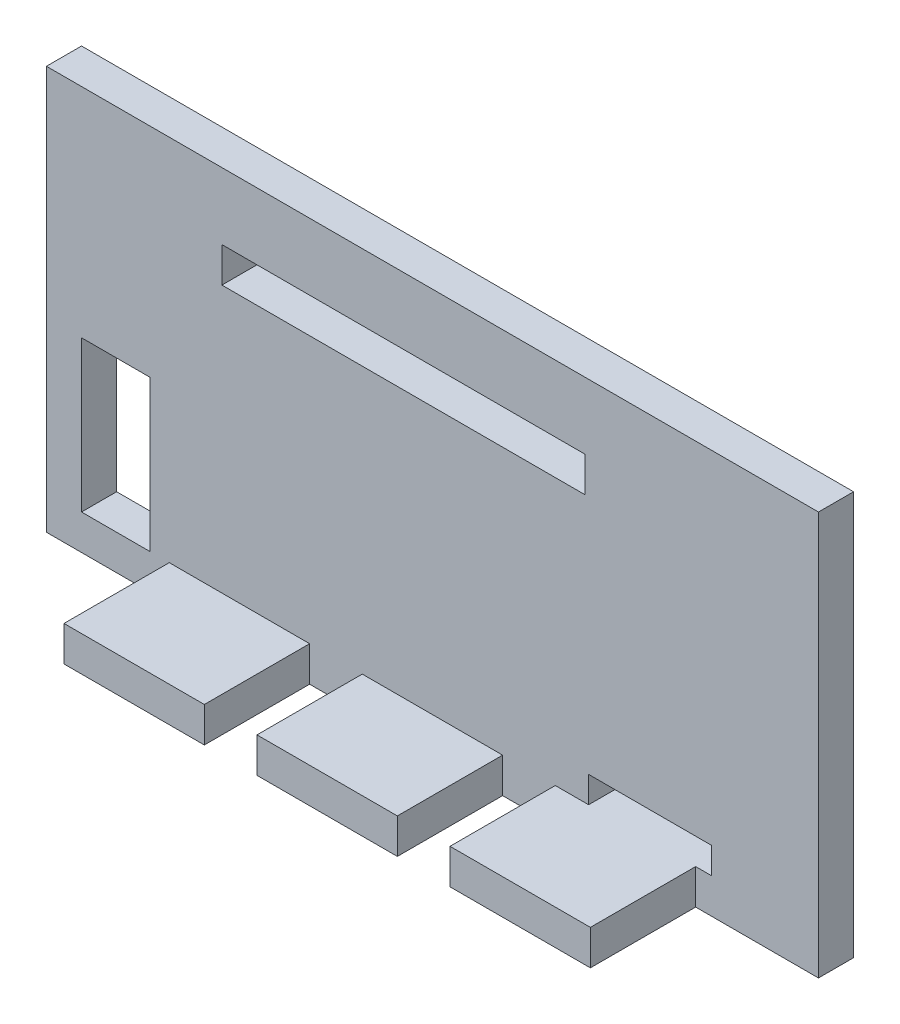
ISO-10303-21;
HEADER;
FILE_DESCRIPTION(('STEP AP214'),'2;1');
FILE_NAME('part.step','',(''),(''),'','','');
FILE_SCHEMA(('AUTOMOTIVE_DESIGN { 1 0 10303 214 1 1 1 1 }'));
ENDSEC;
DATA;
#1=APPLICATION_CONTEXT('core data for automotive mechanical design processes');
#2=APPLICATION_PROTOCOL_DEFINITION('international standard','automotive_design',2000,#1);
#3=PRODUCT_CONTEXT('',#1,'mechanical');
#4=PRODUCT('Part','Part','',(#3));
#5=PRODUCT_RELATED_PRODUCT_CATEGORY('part','',(#4));
#6=PRODUCT_DEFINITION_FORMATION('','',#4);
#7=PRODUCT_DEFINITION_CONTEXT('part definition',#1,'design');
#8=PRODUCT_DEFINITION('design','',#6,#7);
#9=PRODUCT_DEFINITION_SHAPE('','',#8);
#10=(LENGTH_UNIT() NAMED_UNIT(*) SI_UNIT(.MILLI.,.METRE.));
#11=(NAMED_UNIT(*) PLANE_ANGLE_UNIT() SI_UNIT($,.RADIAN.));
#12=(NAMED_UNIT(*) SI_UNIT($,.STERADIAN.) SOLID_ANGLE_UNIT());
#13=UNCERTAINTY_MEASURE_WITH_UNIT(LENGTH_MEASURE(1.E-05),#10,'distance_accuracy_value','');
#14=(GEOMETRIC_REPRESENTATION_CONTEXT(3) GLOBAL_UNCERTAINTY_ASSIGNED_CONTEXT((#13)) GLOBAL_UNIT_ASSIGNED_CONTEXT((#10,
#11,#12)) REPRESENTATION_CONTEXT('',''));
#15=CARTESIAN_POINT('',(0.,0.,0.));
#16=DIRECTION('',(0.,0.,1.));
#17=DIRECTION('',(1.,0.,0.));
#18=AXIS2_PLACEMENT_3D('',#15,#16,#17);
#19=CARTESIAN_POINT('',(0.,0.,2.));
#20=DIRECTION('',(0.,0.,1.));
#21=DIRECTION('',(1.,0.,0.));
#22=AXIS2_PLACEMENT_3D('',#19,#20,#21);
#23=PLANE('',#22);
#24=DIRECTION('',(0.,-1.,0.));
#25=VECTOR('',#24,1.);
#26=CARTESIAN_POINT('',(-20.,-9.5,2.));
#27=LINE('',#26,#25);
#28=CARTESIAN_POINT('',(-20.,-0.899999999999996,2.));
#29=VERTEX_POINT('',#28);
#30=CARTESIAN_POINT('',(-20.,-9.5,2.));
#31=VERTEX_POINT('',#30);
#32=EDGE_CURVE('E317',#29,#31,#27,.T.);
#33=ORIENTED_EDGE('',*,*,#32,.F.);
#34=DIRECTION('',(-1.,0.,0.));
#35=VECTOR('',#34,1.);
#36=CARTESIAN_POINT('',(-20.,-0.899999999999996,2.));
#37=LINE('',#36,#35);
#38=CARTESIAN_POINT('',(-16.1,-0.899999999999996,2.));
#39=VERTEX_POINT('',#38);
#40=EDGE_CURVE('E307',#39,#29,#37,.T.);
#41=ORIENTED_EDGE('',*,*,#40,.F.);
#42=DIRECTION('',(0.,1.,0.));
#43=VECTOR('',#42,1.);
#44=CARTESIAN_POINT('',(-16.1,-9.5,2.));
#45=LINE('',#44,#43);
#46=CARTESIAN_POINT('',(-16.1,-9.5,2.));
#47=VERTEX_POINT('',#46);
#48=EDGE_CURVE('E323',#47,#39,#45,.T.);
#49=ORIENTED_EDGE('',*,*,#48,.F.);
#50=DIRECTION('',(1.,0.,0.));
#51=VECTOR('',#50,1.);
#52=CARTESIAN_POINT('',(-20.,-9.5,2.));
#53=LINE('',#52,#51);
#54=EDGE_CURVE('E319',#31,#47,#53,.T.);
#55=ORIENTED_EDGE('',*,*,#54,.F.);
#56=EDGE_LOOP('',(#33,#41,#49,#55));
#57=FACE_BOUND('',#56,.T.);
#58=DIRECTION('',(0.,-1.,0.));
#59=VECTOR('',#58,1.);
#60=CARTESIAN_POINT('',(-12.,5.7,2.));
#61=LINE('',#60,#59);
#62=CARTESIAN_POINT('',(-12.,7.7,2.));
#63=VERTEX_POINT('',#62);
#64=CARTESIAN_POINT('',(-12.,5.7,2.));
#65=VERTEX_POINT('',#64);
#66=EDGE_CURVE('E302',#63,#65,#61,.T.);
#67=ORIENTED_EDGE('',*,*,#66,.F.);
#68=DIRECTION('',(-1.,0.,0.));
#69=VECTOR('',#68,1.);
#70=CARTESIAN_POINT('',(-12.,7.7,2.));
#71=LINE('',#70,#69);
#72=CARTESIAN_POINT('',(8.70000000000002,7.7,2.));
#73=VERTEX_POINT('',#72);
#74=EDGE_CURVE('E373',#73,#63,#71,.T.);
#75=ORIENTED_EDGE('',*,*,#74,.F.);
#76=DIRECTION('',(0.,1.,0.));
#77=VECTOR('',#76,1.);
#78=CARTESIAN_POINT('',(8.70000000000002,5.7,2.));
#79=LINE('',#78,#77);
#80=CARTESIAN_POINT('',(8.70000000000002,5.7,2.));
#81=VERTEX_POINT('',#80);
#82=EDGE_CURVE('E387',#81,#73,#79,.T.);
#83=ORIENTED_EDGE('',*,*,#82,.F.);
#84=DIRECTION('',(1.,0.,0.));
#85=VECTOR('',#84,1.);
#86=CARTESIAN_POINT('',(-12.,5.7,2.));
#87=LINE('',#86,#85);
#88=EDGE_CURVE('E384',#65,#81,#87,.T.);
#89=ORIENTED_EDGE('',*,*,#88,.F.);
#90=EDGE_LOOP('',(#67,#75,#83,#89));
#91=FACE_BOUND('',#90,.T.);
#92=DIRECTION('',(1.,0.,0.));
#93=VECTOR('',#92,1.);
#94=CARTESIAN_POINT('',(8.90000000000002,-9.5,2.));
#95=LINE('',#94,#93);
#96=CARTESIAN_POINT('',(15.,-9.5,2.));
#97=VERTEX_POINT('',#96);
#98=CARTESIAN_POINT('',(15.9,-9.5,2.));
#99=VERTEX_POINT('',#98);
#100=EDGE_CURVE('E354',#97,#99,#95,.T.);
#101=ORIENTED_EDGE('',*,*,#100,.F.);
#102=DIRECTION('',(0.,1.,0.));
#103=VECTOR('',#102,1.);
#104=CARTESIAN_POINT('',(15.,-11.5,2.));
#105=LINE('',#104,#103);
#106=CARTESIAN_POINT('',(15.,-11.5,2.));
#107=VERTEX_POINT('',#106);
#108=EDGE_CURVE('E48',#107,#97,#105,.T.);
#109=ORIENTED_EDGE('',*,*,#108,.F.);
#110=DIRECTION('',(1.,0.,0.));
#111=VECTOR('',#110,1.);
#112=CARTESIAN_POINT('',(-22.,-11.5,2.));
#113=LINE('',#112,#111);
#114=CARTESIAN_POINT('',(22.,-11.5,2.));
#115=VERTEX_POINT('',#114);
#116=EDGE_CURVE('E407',#107,#115,#113,.T.);
#117=ORIENTED_EDGE('',*,*,#116,.T.);
#118=DIRECTION('',(0.,1.,0.));
#119=VECTOR('',#118,1.);
#120=CARTESIAN_POINT('',(22.,11.5,2.));
#121=LINE('',#120,#119);
#122=CARTESIAN_POINT('',(22.,11.5,2.));
#123=VERTEX_POINT('',#122);
#124=EDGE_CURVE('E399',#115,#123,#121,.T.);
#125=ORIENTED_EDGE('',*,*,#124,.T.);
#126=DIRECTION('',(-1.,0.,0.));
#127=VECTOR('',#126,1.);
#128=CARTESIAN_POINT('',(-22.,11.5,2.));
#129=LINE('',#128,#127);
#130=CARTESIAN_POINT('',(-22.,11.5,2.));
#131=VERTEX_POINT('',#130);
#132=EDGE_CURVE('E402',#123,#131,#129,.T.);
#133=ORIENTED_EDGE('',*,*,#132,.T.);
#134=DIRECTION('',(0.,-1.,0.));
#135=VECTOR('',#134,1.);
#136=CARTESIAN_POINT('',(-22.,11.5,2.));
#137=LINE('',#136,#135);
#138=CARTESIAN_POINT('',(-22.,-11.5,2.));
#139=VERTEX_POINT('',#138);
#140=EDGE_CURVE('E405',#131,#139,#137,.T.);
#141=ORIENTED_EDGE('',*,*,#140,.T.);
#142=CARTESIAN_POINT('',(-15.,-11.5,2.));
#143=VERTEX_POINT('',#142);
#144=EDGE_CURVE('E408',#139,#143,#113,.T.);
#145=ORIENTED_EDGE('',*,*,#144,.T.);
#146=DIRECTION('',(0.,-1.,0.));
#147=VECTOR('',#146,1.);
#148=CARTESIAN_POINT('',(-15.,-11.5,2.));
#149=LINE('',#148,#147);
#150=CARTESIAN_POINT('',(-15.,-9.5,2.));
#151=VERTEX_POINT('',#150);
#152=EDGE_CURVE('E272',#151,#143,#149,.T.);
#153=ORIENTED_EDGE('',*,*,#152,.F.);
#154=DIRECTION('',(-1.,0.,0.));
#155=VECTOR('',#154,1.);
#156=CARTESIAN_POINT('',(-15.,-9.5,2.));
#157=LINE('',#156,#155);
#158=CARTESIAN_POINT('',(-6.99999999999998,-9.5,2.));
#159=VERTEX_POINT('',#158);
#160=EDGE_CURVE('E277',#159,#151,#157,.T.);
#161=ORIENTED_EDGE('',*,*,#160,.F.);
#162=DIRECTION('',(0.,1.,0.));
#163=VECTOR('',#162,1.);
#164=CARTESIAN_POINT('',(-6.99999999999998,-11.5,2.));
#165=LINE('',#164,#163);
#166=CARTESIAN_POINT('',(-6.99999999999998,-11.5,2.));
#167=VERTEX_POINT('',#166);
#168=EDGE_CURVE('E286',#167,#159,#165,.T.);
#169=ORIENTED_EDGE('',*,*,#168,.F.);
#170=CARTESIAN_POINT('',(-3.99999999999998,-11.5,2.));
#171=VERTEX_POINT('',#170);
#172=EDGE_CURVE('E411',#167,#171,#113,.T.);
#173=ORIENTED_EDGE('',*,*,#172,.T.);
#174=DIRECTION('',(0.,-1.,0.));
#175=VECTOR('',#174,1.);
#176=CARTESIAN_POINT('',(-3.99999999999998,-11.5,2.));
#177=LINE('',#176,#175);
#178=CARTESIAN_POINT('',(-3.99999999999998,-9.5,2.));
#179=VERTEX_POINT('',#178);
#180=EDGE_CURVE('E252',#179,#171,#177,.T.);
#181=ORIENTED_EDGE('',*,*,#180,.F.);
#182=DIRECTION('',(-1.,0.,0.));
#183=VECTOR('',#182,1.);
#184=CARTESIAN_POINT('',(-3.99999999999998,-9.5,2.));
#185=LINE('',#184,#183);
#186=CARTESIAN_POINT('',(4.00000000000002,-9.5,2.));
#187=VERTEX_POINT('',#186);
#188=EDGE_CURVE('E56',#187,#179,#185,.T.);
#189=ORIENTED_EDGE('',*,*,#188,.F.);
#190=DIRECTION('',(0.,1.,0.));
#191=VECTOR('',#190,1.);
#192=CARTESIAN_POINT('',(4.00000000000002,-11.5,2.));
#193=LINE('',#192,#191);
#194=CARTESIAN_POINT('',(4.00000000000002,-11.5,2.));
#195=VERTEX_POINT('',#194);
#196=EDGE_CURVE('E240',#195,#187,#193,.T.);
#197=ORIENTED_EDGE('',*,*,#196,.F.);
#198=CARTESIAN_POINT('',(7.00000000000002,-11.5,2.));
#199=VERTEX_POINT('',#198);
#200=EDGE_CURVE('E443',#195,#199,#113,.T.);
#201=ORIENTED_EDGE('',*,*,#200,.T.);
#202=DIRECTION('',(0.,-1.,0.));
#203=VECTOR('',#202,1.);
#204=CARTESIAN_POINT('',(7.00000000000002,-11.5,2.));
#205=LINE('',#204,#203);
#206=CARTESIAN_POINT('',(7.00000000000002,-9.5,2.));
#207=VERTEX_POINT('',#206);
#208=EDGE_CURVE('E237',#207,#199,#205,.T.);
#209=ORIENTED_EDGE('',*,*,#208,.F.);
#210=DIRECTION('',(-1.,0.,0.));
#211=VECTOR('',#210,1.);
#212=CARTESIAN_POINT('',(7.00000000000002,-9.5,2.));
#213=LINE('',#212,#211);
#214=CARTESIAN_POINT('',(8.90000000000002,-9.5,2.));
#215=VERTEX_POINT('',#214);
#216=EDGE_CURVE('E686',#215,#207,#213,.T.);
#217=ORIENTED_EDGE('',*,*,#216,.F.);
#218=DIRECTION('',(0.,-1.,0.));
#219=VECTOR('',#218,1.);
#220=CARTESIAN_POINT('',(8.90000000000002,-9.5,2.));
#221=LINE('',#220,#219);
#222=CARTESIAN_POINT('',(8.90000000000002,-8.,2.));
#223=VERTEX_POINT('',#222);
#224=EDGE_CURVE('E351',#223,#215,#221,.T.);
#225=ORIENTED_EDGE('',*,*,#224,.F.);
#226=DIRECTION('',(-1.,0.,0.));
#227=VECTOR('',#226,1.);
#228=CARTESIAN_POINT('',(8.90000000000002,-8.,2.));
#229=LINE('',#228,#227);
#230=CARTESIAN_POINT('',(15.9,-8.,2.));
#231=VERTEX_POINT('',#230);
#232=EDGE_CURVE('E341',#231,#223,#229,.T.);
#233=ORIENTED_EDGE('',*,*,#232,.F.);
#234=DIRECTION('',(0.,1.,0.));
#235=VECTOR('',#234,1.);
#236=CARTESIAN_POINT('',(15.9,-9.5,2.));
#237=LINE('',#236,#235);
#238=EDGE_CURVE('E357',#99,#231,#237,.T.);
#239=ORIENTED_EDGE('',*,*,#238,.F.);
#240=EDGE_LOOP('',(#101,#109,#117,#125,#133,#141,#145,#153,#161,#169,#173,#181,#189,#197,#201,
#209,#217,#225,#233,#239));
#241=FACE_BOUND('',#240,.T.);
#242=ADVANCED_FACE('F33',(#57,#91,#241),#23,.T.);
#243=CARTESIAN_POINT('',(22.,11.5,2.));
#244=DIRECTION('',(-1.,0.,0.));
#245=DIRECTION('',(0.,-1.,0.));
#246=AXIS2_PLACEMENT_3D('',#243,#244,#245);
#247=PLANE('',#246);
#248=DIRECTION('',(0.,1.,0.));
#249=VECTOR('',#248,1.);
#250=CARTESIAN_POINT('',(22.,11.5,0.));
#251=LINE('',#250,#249);
#252=CARTESIAN_POINT('',(22.,-11.5,0.));
#253=VERTEX_POINT('',#252);
#254=CARTESIAN_POINT('',(22.,11.5,0.));
#255=VERTEX_POINT('',#254);
#256=EDGE_CURVE('E330',#253,#255,#251,.T.);
#257=ORIENTED_EDGE('',*,*,#256,.T.);
#258=DIRECTION('',(0.,0.,-1.));
#259=VECTOR('',#258,1.);
#260=CARTESIAN_POINT('',(22.,11.5,2.));
#261=LINE('',#260,#259);
#262=EDGE_CURVE('E11',#123,#255,#261,.T.);
#263=ORIENTED_EDGE('',*,*,#262,.F.);
#264=ORIENTED_EDGE('',*,*,#124,.F.);
#265=DIRECTION('',(0.,0.,-1.));
#266=VECTOR('',#265,1.);
#267=CARTESIAN_POINT('',(22.,-11.5,2.));
#268=LINE('',#267,#266);
#269=EDGE_CURVE('E410',#115,#253,#268,.T.);
#270=ORIENTED_EDGE('',*,*,#269,.T.);
#271=EDGE_LOOP('',(#257,#263,#264,#270));
#272=FACE_BOUND('',#271,.T.);
#273=ADVANCED_FACE('F35',(#272),#247,.F.);
#274=CARTESIAN_POINT('',(-22.,11.5,2.));
#275=DIRECTION('',(0.,-1.,0.));
#276=DIRECTION('',(0.,0.,-1.));
#277=AXIS2_PLACEMENT_3D('',#274,#275,#276);
#278=PLANE('',#277);
#279=DIRECTION('',(-1.,0.,0.));
#280=VECTOR('',#279,1.);
#281=CARTESIAN_POINT('',(-22.,11.5,0.));
#282=LINE('',#281,#280);
#283=CARTESIAN_POINT('',(-22.,11.5,0.));
#284=VERTEX_POINT('',#283);
#285=EDGE_CURVE('E414',#255,#284,#282,.T.);
#286=ORIENTED_EDGE('',*,*,#285,.T.);
#287=DIRECTION('',(0.,0.,-1.));
#288=VECTOR('',#287,1.);
#289=CARTESIAN_POINT('',(-22.,11.5,2.));
#290=LINE('',#289,#288);
#291=EDGE_CURVE('E41',#131,#284,#290,.T.);
#292=ORIENTED_EDGE('',*,*,#291,.F.);
#293=ORIENTED_EDGE('',*,*,#132,.F.);
#294=ORIENTED_EDGE('',*,*,#262,.T.);
#295=EDGE_LOOP('',(#286,#292,#293,#294));
#296=FACE_BOUND('',#295,.T.);
#297=ADVANCED_FACE('F480',(#296),#278,.F.);
#298=CARTESIAN_POINT('',(-22.,11.5,2.));
#299=DIRECTION('',(1.,0.,0.));
#300=DIRECTION('',(0.,1.,0.));
#301=AXIS2_PLACEMENT_3D('',#298,#299,#300);
#302=PLANE('',#301);
#303=DIRECTION('',(0.,-1.,0.));
#304=VECTOR('',#303,1.);
#305=CARTESIAN_POINT('',(-22.,11.5,0.));
#306=LINE('',#305,#304);
#307=CARTESIAN_POINT('',(-22.,-11.5,0.));
#308=VERTEX_POINT('',#307);
#309=EDGE_CURVE('E416',#284,#308,#306,.T.);
#310=ORIENTED_EDGE('',*,*,#309,.T.);
#311=DIRECTION('',(0.,0.,-1.));
#312=VECTOR('',#311,1.);
#313=CARTESIAN_POINT('',(-22.,-11.5,2.));
#314=LINE('',#313,#312);
#315=EDGE_CURVE('E421',#139,#308,#314,.T.);
#316=ORIENTED_EDGE('',*,*,#315,.F.);
#317=ORIENTED_EDGE('',*,*,#140,.F.);
#318=ORIENTED_EDGE('',*,*,#291,.T.);
#319=EDGE_LOOP('',(#310,#316,#317,#318));
#320=FACE_BOUND('',#319,.T.);
#321=ADVANCED_FACE('F428',(#320),#302,.F.);
#322=CARTESIAN_POINT('',(-22.,-11.5,2.));
#323=DIRECTION('',(0.,1.,0.));
#324=DIRECTION('',(0.,0.,1.));
#325=AXIS2_PLACEMENT_3D('',#322,#323,#324);
#326=PLANE('',#325);
#327=DIRECTION('',(1.,0.,0.));
#328=VECTOR('',#327,1.);
#329=CARTESIAN_POINT('',(-22.,-11.5,0.));
#330=LINE('',#329,#328);
#331=EDGE_CURVE('E403',#308,#253,#330,.T.);
#332=ORIENTED_EDGE('',*,*,#331,.T.);
#333=ORIENTED_EDGE('',*,*,#269,.F.);
#334=ORIENTED_EDGE('',*,*,#116,.F.);
#335=DIRECTION('',(0.,0.,-1.));
#336=VECTOR('',#335,1.);
#337=CARTESIAN_POINT('',(15.,-11.5,8.));
#338=LINE('',#337,#336);
#339=CARTESIAN_POINT('',(15.,-11.5,8.));
#340=VERTEX_POINT('',#339);
#341=EDGE_CURVE('E688',#340,#107,#338,.T.);
#342=ORIENTED_EDGE('',*,*,#341,.F.);
#343=DIRECTION('',(1.,0.,0.));
#344=VECTOR('',#343,1.);
#345=CARTESIAN_POINT('',(7.00000000000002,-11.5,8.));
#346=LINE('',#345,#344);
#347=CARTESIAN_POINT('',(7.00000000000002,-11.5,8.));
#348=VERTEX_POINT('',#347);
#349=EDGE_CURVE('E235',#348,#340,#346,.T.);
#350=ORIENTED_EDGE('',*,*,#349,.F.);
#351=DIRECTION('',(0.,0.,-1.));
#352=VECTOR('',#351,1.);
#353=CARTESIAN_POINT('',(7.00000000000002,-11.5,8.));
#354=LINE('',#353,#352);
#355=EDGE_CURVE('E244',#348,#199,#354,.T.);
#356=ORIENTED_EDGE('',*,*,#355,.T.);
#357=ORIENTED_EDGE('',*,*,#200,.F.);
#358=DIRECTION('',(0.,0.,-1.));
#359=VECTOR('',#358,1.);
#360=CARTESIAN_POINT('',(4.00000000000002,-11.5,8.));
#361=LINE('',#360,#359);
#362=CARTESIAN_POINT('',(4.00000000000002,-11.5,8.));
#363=VERTEX_POINT('',#362);
#364=EDGE_CURVE('E257',#363,#195,#361,.T.);
#365=ORIENTED_EDGE('',*,*,#364,.F.);
#366=DIRECTION('',(1.,0.,0.));
#367=VECTOR('',#366,1.);
#368=CARTESIAN_POINT('',(-3.99999999999998,-11.5,8.));
#369=LINE('',#368,#367);
#370=CARTESIAN_POINT('',(-3.99999999999998,-11.5,8.));
#371=VERTEX_POINT('',#370);
#372=EDGE_CURVE('E256',#371,#363,#369,.T.);
#373=ORIENTED_EDGE('',*,*,#372,.F.);
#374=DIRECTION('',(0.,0.,-1.));
#375=VECTOR('',#374,1.);
#376=CARTESIAN_POINT('',(-3.99999999999998,-11.5,8.));
#377=LINE('',#376,#375);
#378=EDGE_CURVE('E264',#371,#171,#377,.T.);
#379=ORIENTED_EDGE('',*,*,#378,.T.);
#380=ORIENTED_EDGE('',*,*,#172,.F.);
#381=DIRECTION('',(0.,0.,-1.));
#382=VECTOR('',#381,1.);
#383=CARTESIAN_POINT('',(-6.99999999999998,-11.5,8.));
#384=LINE('',#383,#382);
#385=CARTESIAN_POINT('',(-6.99999999999998,-11.5,8.));
#386=VERTEX_POINT('',#385);
#387=EDGE_CURVE('E296',#386,#167,#384,.T.);
#388=ORIENTED_EDGE('',*,*,#387,.F.);
#389=DIRECTION('',(1.,0.,0.));
#390=VECTOR('',#389,1.);
#391=CARTESIAN_POINT('',(-15.,-11.5,8.));
#392=LINE('',#391,#390);
#393=CARTESIAN_POINT('',(-15.,-11.5,8.));
#394=VERTEX_POINT('',#393);
#395=EDGE_CURVE('E276',#394,#386,#392,.T.);
#396=ORIENTED_EDGE('',*,*,#395,.F.);
#397=DIRECTION('',(0.,0.,-1.));
#398=VECTOR('',#397,1.);
#399=CARTESIAN_POINT('',(-15.,-11.5,8.));
#400=LINE('',#399,#398);
#401=EDGE_CURVE('E299',#394,#143,#400,.T.);
#402=ORIENTED_EDGE('',*,*,#401,.T.);
#403=ORIENTED_EDGE('',*,*,#144,.F.);
#404=ORIENTED_EDGE('',*,*,#315,.T.);
#405=EDGE_LOOP('',(#332,#333,#334,#342,#350,#356,#357,#365,#373,#379,#380,#388,#396,#402,#403,#404));
#406=FACE_BOUND('',#405,.T.);
#407=ADVANCED_FACE('F437',(#406),#326,.F.);
#408=CARTESIAN_POINT('',(0.,0.,0.));
#409=DIRECTION('',(0.,0.,1.));
#410=DIRECTION('',(1.,0.,0.));
#411=AXIS2_PLACEMENT_3D('',#408,#409,#410);
#412=PLANE('',#411);
#413=DIRECTION('',(-1.,0.,0.));
#414=VECTOR('',#413,1.);
#415=CARTESIAN_POINT('',(-20.,-0.899999999999996,0.));
#416=LINE('',#415,#414);
#417=CARTESIAN_POINT('',(-16.1,-0.899999999999996,0.));
#418=VERTEX_POINT('',#417);
#419=CARTESIAN_POINT('',(-20.,-0.899999999999996,0.));
#420=VERTEX_POINT('',#419);
#421=EDGE_CURVE('E313',#418,#420,#416,.T.);
#422=ORIENTED_EDGE('',*,*,#421,.T.);
#423=DIRECTION('',(0.,-1.,0.));
#424=VECTOR('',#423,1.);
#425=CARTESIAN_POINT('',(-20.,-9.5,0.));
#426=LINE('',#425,#424);
#427=CARTESIAN_POINT('',(-20.,-9.5,0.));
#428=VERTEX_POINT('',#427);
#429=EDGE_CURVE('E303',#420,#428,#426,.T.);
#430=ORIENTED_EDGE('',*,*,#429,.T.);
#431=DIRECTION('',(1.,0.,0.));
#432=VECTOR('',#431,1.);
#433=CARTESIAN_POINT('',(-20.,-9.5,0.));
#434=LINE('',#433,#432);
#435=CARTESIAN_POINT('',(-16.1,-9.5,0.));
#436=VERTEX_POINT('',#435);
#437=EDGE_CURVE('E306',#428,#436,#434,.T.);
#438=ORIENTED_EDGE('',*,*,#437,.T.);
#439=DIRECTION('',(0.,1.,0.));
#440=VECTOR('',#439,1.);
#441=CARTESIAN_POINT('',(-16.1,-9.5,0.));
#442=LINE('',#441,#440);
#443=EDGE_CURVE('E310',#436,#418,#442,.T.);
#444=ORIENTED_EDGE('',*,*,#443,.T.);
#445=EDGE_LOOP('',(#422,#430,#438,#444));
#446=FACE_BOUND('',#445,.T.);
#447=DIRECTION('',(-1.,0.,0.));
#448=VECTOR('',#447,1.);
#449=CARTESIAN_POINT('',(8.90000000000002,-8.,0.));
#450=LINE('',#449,#448);
#451=CARTESIAN_POINT('',(15.9,-8.,0.));
#452=VERTEX_POINT('',#451);
#453=CARTESIAN_POINT('',(8.90000000000002,-8.,0.));
#454=VERTEX_POINT('',#453);
#455=EDGE_CURVE('E347',#452,#454,#450,.T.);
#456=ORIENTED_EDGE('',*,*,#455,.T.);
#457=DIRECTION('',(0.,-1.,0.));
#458=VECTOR('',#457,1.);
#459=CARTESIAN_POINT('',(8.90000000000002,-9.5,0.));
#460=LINE('',#459,#458);
#461=CARTESIAN_POINT('',(8.90000000000002,-9.5,0.));
#462=VERTEX_POINT('',#461);
#463=EDGE_CURVE('E337',#454,#462,#460,.T.);
#464=ORIENTED_EDGE('',*,*,#463,.T.);
#465=DIRECTION('',(1.,0.,0.));
#466=VECTOR('',#465,1.);
#467=CARTESIAN_POINT('',(8.90000000000002,-9.5,0.));
#468=LINE('',#467,#466);
#469=CARTESIAN_POINT('',(15.9,-9.5,0.));
#470=VERTEX_POINT('',#469);
#471=EDGE_CURVE('E340',#462,#470,#468,.T.);
#472=ORIENTED_EDGE('',*,*,#471,.T.);
#473=DIRECTION('',(0.,1.,0.));
#474=VECTOR('',#473,1.);
#475=CARTESIAN_POINT('',(15.9,-9.5,0.));
#476=LINE('',#475,#474);
#477=EDGE_CURVE('E344',#470,#452,#476,.T.);
#478=ORIENTED_EDGE('',*,*,#477,.T.);
#479=EDGE_LOOP('',(#456,#464,#472,#478));
#480=FACE_BOUND('',#479,.T.);
#481=DIRECTION('',(-1.,0.,0.));
#482=VECTOR('',#481,1.);
#483=CARTESIAN_POINT('',(-12.,7.7,0.));
#484=LINE('',#483,#482);
#485=CARTESIAN_POINT('',(8.70000000000002,7.7,0.));
#486=VERTEX_POINT('',#485);
#487=CARTESIAN_POINT('',(-12.,7.7,0.));
#488=VERTEX_POINT('',#487);
#489=EDGE_CURVE('E379',#486,#488,#484,.T.);
#490=ORIENTED_EDGE('',*,*,#489,.T.);
#491=DIRECTION('',(0.,-1.,0.));
#492=VECTOR('',#491,1.);
#493=CARTESIAN_POINT('',(-12.,5.7,0.));
#494=LINE('',#493,#492);
#495=CARTESIAN_POINT('',(-12.,5.7,0.));
#496=VERTEX_POINT('',#495);
#497=EDGE_CURVE('E369',#488,#496,#494,.T.);
#498=ORIENTED_EDGE('',*,*,#497,.T.);
#499=DIRECTION('',(1.,0.,0.));
#500=VECTOR('',#499,1.);
#501=CARTESIAN_POINT('',(-12.,5.7,0.));
#502=LINE('',#501,#500);
#503=CARTESIAN_POINT('',(8.70000000000002,5.7,0.));
#504=VERTEX_POINT('',#503);
#505=EDGE_CURVE('E372',#496,#504,#502,.T.);
#506=ORIENTED_EDGE('',*,*,#505,.T.);
#507=DIRECTION('',(0.,1.,0.));
#508=VECTOR('',#507,1.);
#509=CARTESIAN_POINT('',(8.70000000000002,5.7,0.));
#510=LINE('',#509,#508);
#511=EDGE_CURVE('E376',#504,#486,#510,.T.);
#512=ORIENTED_EDGE('',*,*,#511,.T.);
#513=EDGE_LOOP('',(#490,#498,#506,#512));
#514=FACE_BOUND('',#513,.T.);
#515=ORIENTED_EDGE('',*,*,#256,.F.);
#516=ORIENTED_EDGE('',*,*,#331,.F.);
#517=ORIENTED_EDGE('',*,*,#309,.F.);
#518=ORIENTED_EDGE('',*,*,#285,.F.);
#519=EDGE_LOOP('',(#515,#516,#517,#518));
#520=FACE_BOUND('',#519,.T.);
#521=ADVANCED_FACE('F434',(#446,#480,#514,#520),#412,.F.);
#522=CARTESIAN_POINT('',(-12.,5.7,0.));
#523=DIRECTION('',(-1.,0.,0.));
#524=DIRECTION('',(0.,0.,1.));
#525=AXIS2_PLACEMENT_3D('',#522,#523,#524);
#526=PLANE('',#525);
#527=ORIENTED_EDGE('',*,*,#66,.T.);
#528=DIRECTION('',(0.,0.,1.));
#529=VECTOR('',#528,1.);
#530=CARTESIAN_POINT('',(-12.,5.7,0.));
#531=LINE('',#530,#529);
#532=EDGE_CURVE('E382',#496,#65,#531,.T.);
#533=ORIENTED_EDGE('',*,*,#532,.F.);
#534=ORIENTED_EDGE('',*,*,#497,.F.);
#535=DIRECTION('',(0.,0.,1.));
#536=VECTOR('',#535,1.);
#537=CARTESIAN_POINT('',(-12.,7.7,0.));
#538=LINE('',#537,#536);
#539=EDGE_CURVE('E355',#488,#63,#538,.T.);
#540=ORIENTED_EDGE('',*,*,#539,.T.);
#541=EDGE_LOOP('',(#527,#533,#534,#540));
#542=FACE_BOUND('',#541,.T.);
#543=ADVANCED_FACE('F485',(#542),#526,.F.);
#544=CARTESIAN_POINT('',(-12.,7.7,0.));
#545=DIRECTION('',(0.,1.,0.));
#546=DIRECTION('',(0.,0.,1.));
#547=AXIS2_PLACEMENT_3D('',#544,#545,#546);
#548=PLANE('',#547);
#549=ORIENTED_EDGE('',*,*,#74,.T.);
#550=ORIENTED_EDGE('',*,*,#539,.F.);
#551=ORIENTED_EDGE('',*,*,#489,.F.);
#552=DIRECTION('',(0.,0.,1.));
#553=VECTOR('',#552,1.);
#554=CARTESIAN_POINT('',(8.70000000000002,7.7,0.));
#555=LINE('',#554,#553);
#556=EDGE_CURVE('E393',#486,#73,#555,.T.);
#557=ORIENTED_EDGE('',*,*,#556,.T.);
#558=EDGE_LOOP('',(#549,#550,#551,#557));
#559=FACE_BOUND('',#558,.T.);
#560=ADVANCED_FACE('F517',(#559),#548,.F.);
#561=CARTESIAN_POINT('',(8.70000000000002,5.7,0.));
#562=DIRECTION('',(1.,0.,0.));
#563=DIRECTION('',(0.,0.,-1.));
#564=AXIS2_PLACEMENT_3D('',#561,#562,#563);
#565=PLANE('',#564);
#566=ORIENTED_EDGE('',*,*,#82,.T.);
#567=ORIENTED_EDGE('',*,*,#556,.F.);
#568=ORIENTED_EDGE('',*,*,#511,.F.);
#569=DIRECTION('',(0.,0.,1.));
#570=VECTOR('',#569,1.);
#571=CARTESIAN_POINT('',(8.70000000000002,5.7,0.));
#572=LINE('',#571,#570);
#573=EDGE_CURVE('E395',#504,#81,#572,.T.);
#574=ORIENTED_EDGE('',*,*,#573,.T.);
#575=EDGE_LOOP('',(#566,#567,#568,#574));
#576=FACE_BOUND('',#575,.T.);
#577=ADVANCED_FACE('F524',(#576),#565,.F.);
#578=CARTESIAN_POINT('',(-12.,5.7,0.));
#579=DIRECTION('',(0.,-1.,0.));
#580=DIRECTION('',(0.,0.,-1.));
#581=AXIS2_PLACEMENT_3D('',#578,#579,#580);
#582=PLANE('',#581);
#583=ORIENTED_EDGE('',*,*,#88,.T.);
#584=ORIENTED_EDGE('',*,*,#573,.F.);
#585=ORIENTED_EDGE('',*,*,#505,.F.);
#586=ORIENTED_EDGE('',*,*,#532,.T.);
#587=EDGE_LOOP('',(#583,#584,#585,#586));
#588=FACE_BOUND('',#587,.T.);
#589=ADVANCED_FACE('F532',(#588),#582,.F.);
#590=CARTESIAN_POINT('',(8.90000000000002,-9.5,0.));
#591=DIRECTION('',(-1.,0.,0.));
#592=DIRECTION('',(0.,0.,1.));
#593=AXIS2_PLACEMENT_3D('',#590,#591,#592);
#594=PLANE('',#593);
#595=ORIENTED_EDGE('',*,*,#224,.T.);
#596=DIRECTION('',(0.,0.,1.));
#597=VECTOR('',#596,1.);
#598=CARTESIAN_POINT('',(8.90000000000002,-9.5,0.));
#599=LINE('',#598,#597);
#600=EDGE_CURVE('E350',#462,#215,#599,.T.);
#601=ORIENTED_EDGE('',*,*,#600,.F.);
#602=ORIENTED_EDGE('',*,*,#463,.F.);
#603=DIRECTION('',(0.,0.,1.));
#604=VECTOR('',#603,1.);
#605=CARTESIAN_POINT('',(8.90000000000002,-8.,0.));
#606=LINE('',#605,#604);
#607=EDGE_CURVE('E320',#454,#223,#606,.T.);
#608=ORIENTED_EDGE('',*,*,#607,.T.);
#609=EDGE_LOOP('',(#595,#601,#602,#608));
#610=FACE_BOUND('',#609,.T.);
#611=ADVANCED_FACE('F540',(#610),#594,.F.);
#612=CARTESIAN_POINT('',(8.90000000000002,-8.,0.));
#613=DIRECTION('',(0.,1.,0.));
#614=DIRECTION('',(0.,0.,1.));
#615=AXIS2_PLACEMENT_3D('',#612,#613,#614);
#616=PLANE('',#615);
#617=ORIENTED_EDGE('',*,*,#232,.T.);
#618=ORIENTED_EDGE('',*,*,#607,.F.);
#619=ORIENTED_EDGE('',*,*,#455,.F.);
#620=DIRECTION('',(0.,0.,1.));
#621=VECTOR('',#620,1.);
#622=CARTESIAN_POINT('',(15.9,-8.,0.));
#623=LINE('',#622,#621);
#624=EDGE_CURVE('E363',#452,#231,#623,.T.);
#625=ORIENTED_EDGE('',*,*,#624,.T.);
#626=EDGE_LOOP('',(#617,#618,#619,#625));
#627=FACE_BOUND('',#626,.T.);
#628=ADVANCED_FACE('F547',(#627),#616,.F.);
#629=CARTESIAN_POINT('',(15.9,-9.5,0.));
#630=DIRECTION('',(1.,0.,0.));
#631=DIRECTION('',(0.,0.,-1.));
#632=AXIS2_PLACEMENT_3D('',#629,#630,#631);
#633=PLANE('',#632);
#634=ORIENTED_EDGE('',*,*,#238,.T.);
#635=ORIENTED_EDGE('',*,*,#624,.F.);
#636=ORIENTED_EDGE('',*,*,#477,.F.);
#637=DIRECTION('',(0.,0.,1.));
#638=VECTOR('',#637,1.);
#639=CARTESIAN_POINT('',(15.9,-9.5,0.));
#640=LINE('',#639,#638);
#641=EDGE_CURVE('E365',#470,#99,#640,.T.);
#642=ORIENTED_EDGE('',*,*,#641,.T.);
#643=EDGE_LOOP('',(#634,#635,#636,#642));
#644=FACE_BOUND('',#643,.T.);
#645=ADVANCED_FACE('F555',(#644),#633,.F.);
#646=CARTESIAN_POINT('',(8.90000000000002,-9.5,0.));
#647=DIRECTION('',(0.,-1.,0.));
#648=DIRECTION('',(0.,0.,-1.));
#649=AXIS2_PLACEMENT_3D('',#646,#647,#648);
#650=PLANE('',#649);
#651=ORIENTED_EDGE('',*,*,#600,.T.);
#652=ORIENTED_EDGE('',*,*,#216,.T.);
#653=DIRECTION('',(0.,0.,-1.));
#654=VECTOR('',#653,1.);
#655=CARTESIAN_POINT('',(7.00000000000002,-9.5,8.));
#656=LINE('',#655,#654);
#657=CARTESIAN_POINT('',(7.00000000000002,-9.5,8.));
#658=VERTEX_POINT('',#657);
#659=EDGE_CURVE('E226',#658,#207,#656,.T.);
#660=ORIENTED_EDGE('',*,*,#659,.F.);
#661=DIRECTION('',(-1.,0.,0.));
#662=VECTOR('',#661,1.);
#663=CARTESIAN_POINT('',(7.00000000000002,-9.5,8.));
#664=LINE('',#663,#662);
#665=CARTESIAN_POINT('',(15.,-9.5,8.));
#666=VERTEX_POINT('',#665);
#667=EDGE_CURVE('E219',#666,#658,#664,.T.);
#668=ORIENTED_EDGE('',*,*,#667,.F.);
#669=DIRECTION('',(0.,0.,-1.));
#670=VECTOR('',#669,1.);
#671=CARTESIAN_POINT('',(15.,-9.5,8.));
#672=LINE('',#671,#670);
#673=EDGE_CURVE('E223',#666,#97,#672,.T.);
#674=ORIENTED_EDGE('',*,*,#673,.T.);
#675=ORIENTED_EDGE('',*,*,#100,.T.);
#676=ORIENTED_EDGE('',*,*,#641,.F.);
#677=ORIENTED_EDGE('',*,*,#471,.F.);
#678=EDGE_LOOP('',(#651,#652,#660,#668,#674,#675,#676,#677));
#679=FACE_BOUND('',#678,.T.);
#680=ADVANCED_FACE('F222',(#679),#650,.F.);
#681=CARTESIAN_POINT('',(-20.,-9.5,0.));
#682=DIRECTION('',(-1.,0.,0.));
#683=DIRECTION('',(0.,0.,1.));
#684=AXIS2_PLACEMENT_3D('',#681,#682,#683);
#685=PLANE('',#684);
#686=ORIENTED_EDGE('',*,*,#32,.T.);
#687=DIRECTION('',(0.,0.,1.));
#688=VECTOR('',#687,1.);
#689=CARTESIAN_POINT('',(-20.,-9.5,0.));
#690=LINE('',#689,#688);
#691=EDGE_CURVE('E316',#428,#31,#690,.T.);
#692=ORIENTED_EDGE('',*,*,#691,.F.);
#693=ORIENTED_EDGE('',*,*,#429,.F.);
#694=DIRECTION('',(0.,0.,1.));
#695=VECTOR('',#694,1.);
#696=CARTESIAN_POINT('',(-20.,-0.899999999999996,0.));
#697=LINE('',#696,#695);
#698=EDGE_CURVE('E328',#420,#29,#697,.T.);
#699=ORIENTED_EDGE('',*,*,#698,.T.);
#700=EDGE_LOOP('',(#686,#692,#693,#699));
#701=FACE_BOUND('',#700,.T.);
#702=ADVANCED_FACE('F570',(#701),#685,.F.);
#703=CARTESIAN_POINT('',(-20.,-0.899999999999996,0.));
#704=DIRECTION('',(0.,1.,0.));
#705=DIRECTION('',(0.,0.,1.));
#706=AXIS2_PLACEMENT_3D('',#703,#704,#705);
#707=PLANE('',#706);
#708=ORIENTED_EDGE('',*,*,#40,.T.);
#709=ORIENTED_EDGE('',*,*,#698,.F.);
#710=ORIENTED_EDGE('',*,*,#421,.F.);
#711=DIRECTION('',(0.,0.,1.));
#712=VECTOR('',#711,1.);
#713=CARTESIAN_POINT('',(-16.1,-0.899999999999996,0.));
#714=LINE('',#713,#712);
#715=EDGE_CURVE('E331',#418,#39,#714,.T.);
#716=ORIENTED_EDGE('',*,*,#715,.T.);
#717=EDGE_LOOP('',(#708,#709,#710,#716));
#718=FACE_BOUND('',#717,.T.);
#719=ADVANCED_FACE('F577',(#718),#707,.F.);
#720=CARTESIAN_POINT('',(-16.1,-9.5,0.));
#721=DIRECTION('',(1.,0.,0.));
#722=DIRECTION('',(0.,0.,-1.));
#723=AXIS2_PLACEMENT_3D('',#720,#721,#722);
#724=PLANE('',#723);
#725=ORIENTED_EDGE('',*,*,#48,.T.);
#726=ORIENTED_EDGE('',*,*,#715,.F.);
#727=ORIENTED_EDGE('',*,*,#443,.F.);
#728=DIRECTION('',(0.,0.,1.));
#729=VECTOR('',#728,1.);
#730=CARTESIAN_POINT('',(-16.1,-9.5,0.));
#731=LINE('',#730,#729);
#732=EDGE_CURVE('E333',#436,#47,#731,.T.);
#733=ORIENTED_EDGE('',*,*,#732,.T.);
#734=EDGE_LOOP('',(#725,#726,#727,#733));
#735=FACE_BOUND('',#734,.T.);
#736=ADVANCED_FACE('F585',(#735),#724,.F.);
#737=CARTESIAN_POINT('',(-20.,-9.5,0.));
#738=DIRECTION('',(0.,-1.,0.));
#739=DIRECTION('',(0.,0.,-1.));
#740=AXIS2_PLACEMENT_3D('',#737,#738,#739);
#741=PLANE('',#740);
#742=ORIENTED_EDGE('',*,*,#54,.T.);
#743=ORIENTED_EDGE('',*,*,#732,.F.);
#744=ORIENTED_EDGE('',*,*,#437,.F.);
#745=ORIENTED_EDGE('',*,*,#691,.T.);
#746=EDGE_LOOP('',(#742,#743,#744,#745));
#747=FACE_BOUND('',#746,.T.);
#748=ADVANCED_FACE('F593',(#747),#741,.F.);
#749=CARTESIAN_POINT('',(-15.,-11.5,8.));
#750=DIRECTION('',(1.,0.,0.));
#751=DIRECTION('',(0.,0.,-1.));
#752=AXIS2_PLACEMENT_3D('',#749,#750,#751);
#753=PLANE('',#752);
#754=ORIENTED_EDGE('',*,*,#152,.T.);
#755=ORIENTED_EDGE('',*,*,#401,.F.);
#756=DIRECTION('',(0.,-1.,0.));
#757=VECTOR('',#756,1.);
#758=CARTESIAN_POINT('',(-15.,-11.5,8.));
#759=LINE('',#758,#757);
#760=CARTESIAN_POINT('',(-15.,-9.5,8.));
#761=VERTEX_POINT('',#760);
#762=EDGE_CURVE('E273',#761,#394,#759,.T.);
#763=ORIENTED_EDGE('',*,*,#762,.F.);
#764=DIRECTION('',(0.,0.,-1.));
#765=VECTOR('',#764,1.);
#766=CARTESIAN_POINT('',(-15.,-9.5,8.));
#767=LINE('',#766,#765);
#768=EDGE_CURVE('E283',#761,#151,#767,.T.);
#769=ORIENTED_EDGE('',*,*,#768,.T.);
#770=EDGE_LOOP('',(#754,#755,#763,#769));
#771=FACE_BOUND('',#770,.T.);
#772=ADVANCED_FACE('F601',(#771),#753,.F.);
#773=CARTESIAN_POINT('',(-6.99999999999998,-11.5,8.));
#774=DIRECTION('',(-1.,0.,0.));
#775=DIRECTION('',(0.,0.,1.));
#776=AXIS2_PLACEMENT_3D('',#773,#774,#775);
#777=PLANE('',#776);
#778=ORIENTED_EDGE('',*,*,#168,.T.);
#779=DIRECTION('',(0.,0.,-1.));
#780=VECTOR('',#779,1.);
#781=CARTESIAN_POINT('',(-6.99999999999998,-9.5,8.));
#782=LINE('',#781,#780);
#783=CARTESIAN_POINT('',(-6.99999999999998,-9.5,8.));
#784=VERTEX_POINT('',#783);
#785=EDGE_CURVE('E293',#784,#159,#782,.T.);
#786=ORIENTED_EDGE('',*,*,#785,.F.);
#787=DIRECTION('',(0.,1.,0.));
#788=VECTOR('',#787,1.);
#789=CARTESIAN_POINT('',(-6.99999999999998,-11.5,8.));
#790=LINE('',#789,#788);
#791=EDGE_CURVE('E279',#386,#784,#790,.T.);
#792=ORIENTED_EDGE('',*,*,#791,.F.);
#793=ORIENTED_EDGE('',*,*,#387,.T.);
#794=EDGE_LOOP('',(#778,#786,#792,#793));
#795=FACE_BOUND('',#794,.T.);
#796=ADVANCED_FACE('F608',(#795),#777,.F.);
#797=CARTESIAN_POINT('',(-15.,-9.5,8.));
#798=DIRECTION('',(0.,-1.,0.));
#799=DIRECTION('',(0.,0.,-1.));
#800=AXIS2_PLACEMENT_3D('',#797,#798,#799);
#801=PLANE('',#800);
#802=ORIENTED_EDGE('',*,*,#160,.T.);
#803=ORIENTED_EDGE('',*,*,#768,.F.);
#804=DIRECTION('',(-1.,0.,0.));
#805=VECTOR('',#804,1.);
#806=CARTESIAN_POINT('',(-15.,-9.5,8.));
#807=LINE('',#806,#805);
#808=EDGE_CURVE('E281',#784,#761,#807,.T.);
#809=ORIENTED_EDGE('',*,*,#808,.F.);
#810=ORIENTED_EDGE('',*,*,#785,.T.);
#811=EDGE_LOOP('',(#802,#803,#809,#810));
#812=FACE_BOUND('',#811,.T.);
#813=ADVANCED_FACE('F471',(#812),#801,.F.);
#814=CARTESIAN_POINT('',(0.,0.,8.));
#815=DIRECTION('',(0.,0.,-1.));
#816=DIRECTION('',(-1.,0.,0.));
#817=AXIS2_PLACEMENT_3D('',#814,#815,#816);
#818=PLANE('',#817);
#819=ORIENTED_EDGE('',*,*,#762,.T.);
#820=ORIENTED_EDGE('',*,*,#395,.T.);
#821=ORIENTED_EDGE('',*,*,#791,.T.);
#822=ORIENTED_EDGE('',*,*,#808,.T.);
#823=EDGE_LOOP('',(#819,#820,#821,#822));
#824=FACE_BOUND('',#823,.T.);
#825=ADVANCED_FACE('F464',(#824),#818,.F.);
#826=CARTESIAN_POINT('',(4.00000000000002,-11.5,8.));
#827=DIRECTION('',(-1.,0.,0.));
#828=DIRECTION('',(0.,0.,1.));
#829=AXIS2_PLACEMENT_3D('',#826,#827,#828);
#830=PLANE('',#829);
#831=ORIENTED_EDGE('',*,*,#196,.T.);
#832=DIRECTION('',(0.,0.,-1.));
#833=VECTOR('',#832,1.);
#834=CARTESIAN_POINT('',(4.00000000000002,-9.5,8.));
#835=LINE('',#834,#833);
#836=CARTESIAN_POINT('',(4.00000000000002,-9.5,8.));
#837=VERTEX_POINT('',#836);
#838=EDGE_CURVE('E270',#837,#187,#835,.T.);
#839=ORIENTED_EDGE('',*,*,#838,.F.);
#840=DIRECTION('',(0.,1.,0.));
#841=VECTOR('',#840,1.);
#842=CARTESIAN_POINT('',(4.00000000000002,-11.5,8.));
#843=LINE('',#842,#841);
#844=EDGE_CURVE('E248',#363,#837,#843,.T.);
#845=ORIENTED_EDGE('',*,*,#844,.F.);
#846=ORIENTED_EDGE('',*,*,#364,.T.);
#847=EDGE_LOOP('',(#831,#839,#845,#846));
#848=FACE_BOUND('',#847,.T.);
#849=ADVANCED_FACE('F462',(#848),#830,.F.);
#850=CARTESIAN_POINT('',(-3.99999999999998,-9.5,8.));
#851=DIRECTION('',(0.,-1.,0.));
#852=DIRECTION('',(0.,0.,-1.));
#853=AXIS2_PLACEMENT_3D('',#850,#851,#852);
#854=PLANE('',#853);
#855=ORIENTED_EDGE('',*,*,#188,.T.);
#856=DIRECTION('',(0.,0.,-1.));
#857=VECTOR('',#856,1.);
#858=CARTESIAN_POINT('',(-3.99999999999998,-9.5,8.));
#859=LINE('',#858,#857);
#860=CARTESIAN_POINT('',(-3.99999999999998,-9.5,8.));
#861=VERTEX_POINT('',#860);
#862=EDGE_CURVE('E267',#861,#179,#859,.T.);
#863=ORIENTED_EDGE('',*,*,#862,.F.);
#864=DIRECTION('',(-1.,0.,0.));
#865=VECTOR('',#864,1.);
#866=CARTESIAN_POINT('',(-3.99999999999998,-9.5,8.));
#867=LINE('',#866,#865);
#868=EDGE_CURVE('E251',#837,#861,#867,.T.);
#869=ORIENTED_EDGE('',*,*,#868,.F.);
#870=ORIENTED_EDGE('',*,*,#838,.T.);
#871=EDGE_LOOP('',(#855,#863,#869,#870));
#872=FACE_BOUND('',#871,.T.);
#873=ADVANCED_FACE('F460',(#872),#854,.F.);
#874=CARTESIAN_POINT('',(-3.99999999999998,-11.5,8.));
#875=DIRECTION('',(1.,0.,0.));
#876=DIRECTION('',(0.,0.,-1.));
#877=AXIS2_PLACEMENT_3D('',#874,#875,#876);
#878=PLANE('',#877);
#879=ORIENTED_EDGE('',*,*,#180,.T.);
#880=ORIENTED_EDGE('',*,*,#378,.F.);
#881=DIRECTION('',(0.,-1.,0.));
#882=VECTOR('',#881,1.);
#883=CARTESIAN_POINT('',(-3.99999999999998,-11.5,8.));
#884=LINE('',#883,#882);
#885=EDGE_CURVE('E254',#861,#371,#884,.T.);
#886=ORIENTED_EDGE('',*,*,#885,.F.);
#887=ORIENTED_EDGE('',*,*,#862,.T.);
#888=EDGE_LOOP('',(#879,#880,#886,#887));
#889=FACE_BOUND('',#888,.T.);
#890=ADVANCED_FACE('F450',(#889),#878,.F.);
#891=CARTESIAN_POINT('',(0.,0.,8.));
#892=DIRECTION('',(0.,0.,-1.));
#893=DIRECTION('',(-1.,0.,0.));
#894=AXIS2_PLACEMENT_3D('',#891,#892,#893);
#895=PLANE('',#894);
#896=ORIENTED_EDGE('',*,*,#844,.T.);
#897=ORIENTED_EDGE('',*,*,#868,.T.);
#898=ORIENTED_EDGE('',*,*,#885,.T.);
#899=ORIENTED_EDGE('',*,*,#372,.T.);
#900=EDGE_LOOP('',(#896,#897,#898,#899));
#901=FACE_BOUND('',#900,.T.);
#902=ADVANCED_FACE('F457',(#901),#895,.F.);
#903=CARTESIAN_POINT('',(15.,-11.5,8.));
#904=DIRECTION('',(-1.,0.,0.));
#905=DIRECTION('',(0.,0.,1.));
#906=AXIS2_PLACEMENT_3D('',#903,#904,#905);
#907=PLANE('',#906);
#908=ORIENTED_EDGE('',*,*,#108,.T.);
#909=ORIENTED_EDGE('',*,*,#673,.F.);
#910=DIRECTION('',(0.,1.,0.));
#911=VECTOR('',#910,1.);
#912=CARTESIAN_POINT('',(15.,-11.5,8.));
#913=LINE('',#912,#911);
#914=EDGE_CURVE('E230',#340,#666,#913,.T.);
#915=ORIENTED_EDGE('',*,*,#914,.F.);
#916=ORIENTED_EDGE('',*,*,#341,.T.);
#917=EDGE_LOOP('',(#908,#909,#915,#916));
#918=FACE_BOUND('',#917,.T.);
#919=ADVANCED_FACE('F239',(#918),#907,.F.);
#920=CARTESIAN_POINT('',(7.00000000000002,-11.5,8.));
#921=DIRECTION('',(1.,0.,0.));
#922=DIRECTION('',(0.,0.,-1.));
#923=AXIS2_PLACEMENT_3D('',#920,#921,#922);
#924=PLANE('',#923);
#925=ORIENTED_EDGE('',*,*,#208,.T.);
#926=ORIENTED_EDGE('',*,*,#355,.F.);
#927=DIRECTION('',(0.,-1.,0.));
#928=VECTOR('',#927,1.);
#929=CARTESIAN_POINT('',(7.00000000000002,-11.5,8.));
#930=LINE('',#929,#928);
#931=EDGE_CURVE('E229',#658,#348,#930,.T.);
#932=ORIENTED_EDGE('',*,*,#931,.F.);
#933=ORIENTED_EDGE('',*,*,#659,.T.);
#934=EDGE_LOOP('',(#925,#926,#932,#933));
#935=FACE_BOUND('',#934,.T.);
#936=ADVANCED_FACE('F663',(#935),#924,.F.);
#937=CARTESIAN_POINT('',(0.,0.,8.));
#938=DIRECTION('',(0.,0.,-1.));
#939=DIRECTION('',(-1.,0.,0.));
#940=AXIS2_PLACEMENT_3D('',#937,#938,#939);
#941=PLANE('',#940);
#942=ORIENTED_EDGE('',*,*,#914,.T.);
#943=ORIENTED_EDGE('',*,*,#667,.T.);
#944=ORIENTED_EDGE('',*,*,#931,.T.);
#945=ORIENTED_EDGE('',*,*,#349,.T.);
#946=EDGE_LOOP('',(#942,#943,#944,#945));
#947=FACE_BOUND('',#946,.T.);
#948=ADVANCED_FACE('F233',(#947),#941,.F.);
#949=CLOSED_SHELL('',(#242,#273,#297,#321,#407,#521,#543,#560,#577,#589,#611,#628,#645,#680,
#702,#719,#736,#748,#772,#796,#813,#825,#849,#873,#890,#902,#919,#936,#948));
#950=MANIFOLD_SOLID_BREP('B2',#949);
#951=ADVANCED_BREP_SHAPE_REPRESENTATION('',(#18,#950),#14);
#952=SHAPE_DEFINITION_REPRESENTATION(#9,#951);
ENDSEC;
END-ISO-10303-21;
